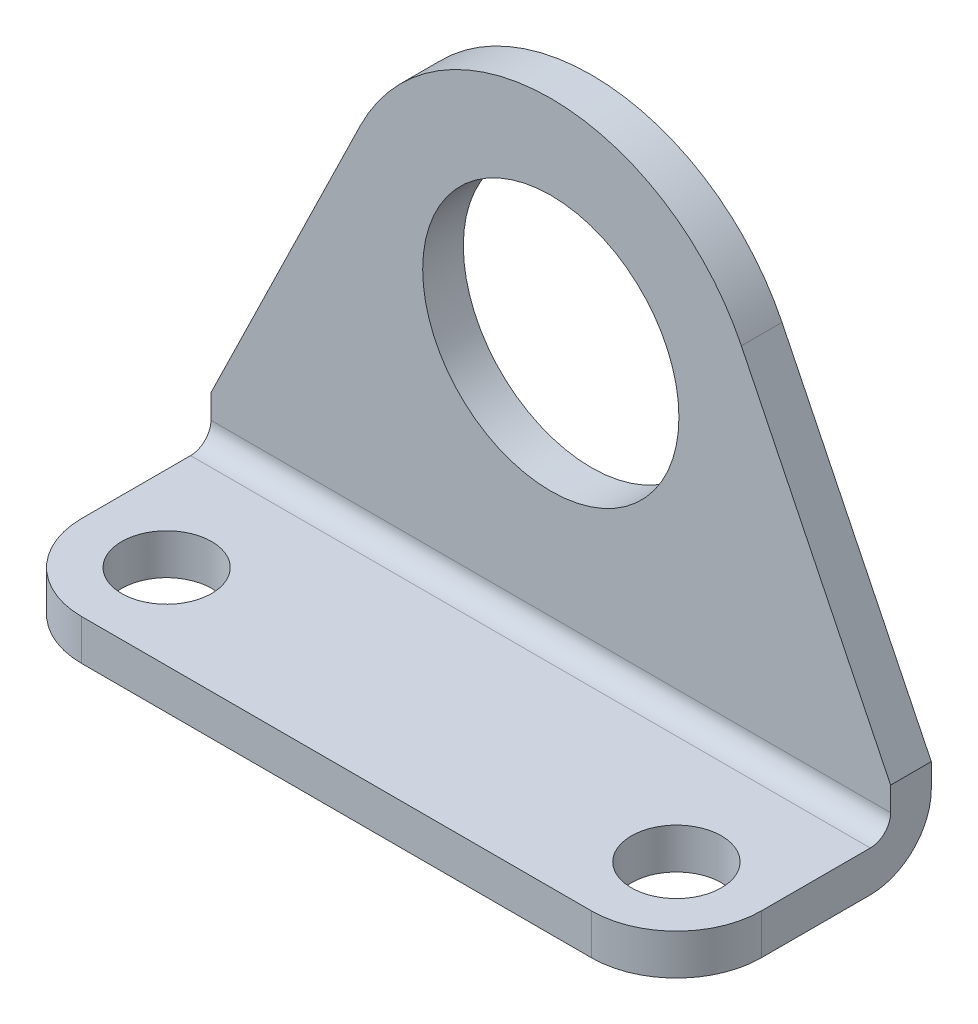
ISO-10303-21;
HEADER;
FILE_DESCRIPTION(('STEP AP214'),'2;1');
FILE_NAME('part.step','',(''),(''),'','','');
FILE_SCHEMA(('AUTOMOTIVE_DESIGN { 1 0 10303 214 1 1 1 1 }'));
ENDSEC;
DATA;
#1=APPLICATION_CONTEXT('core data for automotive mechanical design processes');
#2=APPLICATION_PROTOCOL_DEFINITION('international standard','automotive_design',2000,#1);
#3=PRODUCT_CONTEXT('',#1,'mechanical');
#4=PRODUCT('Part','Part','',(#3));
#5=PRODUCT_RELATED_PRODUCT_CATEGORY('part','',(#4));
#6=PRODUCT_DEFINITION_FORMATION('','',#4);
#7=PRODUCT_DEFINITION_CONTEXT('part definition',#1,'design');
#8=PRODUCT_DEFINITION('design','',#6,#7);
#9=PRODUCT_DEFINITION_SHAPE('','',#8);
#10=(LENGTH_UNIT() NAMED_UNIT(*) SI_UNIT(.MILLI.,.METRE.));
#11=(NAMED_UNIT(*) PLANE_ANGLE_UNIT() SI_UNIT($,.RADIAN.));
#12=(NAMED_UNIT(*) SI_UNIT($,.STERADIAN.) SOLID_ANGLE_UNIT());
#13=UNCERTAINTY_MEASURE_WITH_UNIT(LENGTH_MEASURE(1.E-05),#10,'distance_accuracy_value','');
#14=(GEOMETRIC_REPRESENTATION_CONTEXT(3) GLOBAL_UNCERTAINTY_ASSIGNED_CONTEXT((#13)) GLOBAL_UNIT_ASSIGNED_CONTEXT((#10,
#11,#12)) REPRESENTATION_CONTEXT('',''));
#15=CARTESIAN_POINT('',(0.,0.,0.));
#16=DIRECTION('',(0.,0.,1.));
#17=DIRECTION('',(1.,0.,0.));
#18=AXIS2_PLACEMENT_3D('',#15,#16,#17);
#19=CARTESIAN_POINT('',(25.4,1.51892,2.28092));
#20=DIRECTION('',(0.,-1.,0.));
#21=DIRECTION('',(0.,0.,-1.));
#22=AXIS2_PLACEMENT_3D('',#19,#20,#21);
#23=PLANE('',#22);
#24=CARTESIAN_POINT('',(22.225,1.51892,6.35));
#25=DIRECTION('',(0.,-1.,0.));
#26=DIRECTION('',(0.,0.,-1.));
#27=AXIS2_PLACEMENT_3D('',#24,#25,#26);
#28=CIRCLE('',#27,1.68275);
#29=CARTESIAN_POINT('',(22.225,1.51892,4.66725));
#30=VERTEX_POINT('',#29);
#31=EDGE_CURVE('E248',#30,#30,#28,.F.);
#32=ORIENTED_EDGE('',*,*,#31,.F.);
#33=EDGE_LOOP('',(#32));
#34=FACE_BOUND('',#33,.T.);
#35=CARTESIAN_POINT('',(3.175,1.51892,6.35));
#36=DIRECTION('',(0.,-1.,0.));
#37=DIRECTION('',(0.,0.,-1.));
#38=AXIS2_PLACEMENT_3D('',#35,#36,#37);
#39=CIRCLE('',#38,1.68275);
#40=CARTESIAN_POINT('',(3.175,1.51892,4.66725));
#41=VERTEX_POINT('',#40);
#42=EDGE_CURVE('E254',#41,#41,#39,.F.);
#43=ORIENTED_EDGE('',*,*,#42,.F.);
#44=EDGE_LOOP('',(#43));
#45=FACE_BOUND('',#44,.T.);
#46=CARTESIAN_POINT('',(22.2249999999995,1.51892,6.34999999999953));
#47=DIRECTION('',(0.,-1.,0.));
#48=DIRECTION('',(0.,0.,-1.));
#49=AXIS2_PLACEMENT_3D('',#46,#47,#48);
#50=CIRCLE('',#49,3.17500000000047);
#51=CARTESIAN_POINT('',(25.4,1.51892,6.35));
#52=VERTEX_POINT('',#51);
#53=CARTESIAN_POINT('',(22.225,1.51892,9.525));
#54=VERTEX_POINT('',#53);
#55=EDGE_CURVE('E124',#52,#54,#50,.T.);
#56=ORIENTED_EDGE('',*,*,#55,.F.);
#57=DIRECTION('',(0.,0.,1.));
#58=VECTOR('',#57,1.);
#59=CARTESIAN_POINT('',(25.4,1.51892,2.28092));
#60=LINE('',#59,#58);
#61=CARTESIAN_POINT('',(25.4,1.51892,2.28092));
#62=VERTEX_POINT('',#61);
#63=EDGE_CURVE('E188',#62,#52,#60,.T.);
#64=ORIENTED_EDGE('',*,*,#63,.F.);
#65=DIRECTION('',(-1.,0.,0.));
#66=VECTOR('',#65,1.);
#67=CARTESIAN_POINT('',(25.4,1.51892,2.28092));
#68=LINE('',#67,#66);
#69=CARTESIAN_POINT('',(0.,1.51892,2.28092));
#70=VERTEX_POINT('',#69);
#71=EDGE_CURVE('E189',#62,#70,#68,.T.);
#72=ORIENTED_EDGE('',*,*,#71,.T.);
#73=DIRECTION('',(0.,0.,1.));
#74=VECTOR('',#73,1.);
#75=CARTESIAN_POINT('',(0.,1.51892,2.28092));
#76=LINE('',#75,#74);
#77=CARTESIAN_POINT('',(0.,1.51892,6.35));
#78=VERTEX_POINT('',#77);
#79=EDGE_CURVE('E174',#70,#78,#76,.T.);
#80=ORIENTED_EDGE('',*,*,#79,.T.);
#81=CARTESIAN_POINT('',(3.17499999999998,1.51892,6.35000000000002));
#82=DIRECTION('',(0.,-1.,0.));
#83=DIRECTION('',(0.,0.,-1.));
#84=AXIS2_PLACEMENT_3D('',#81,#82,#83);
#85=CIRCLE('',#84,3.17499999999998);
#86=CARTESIAN_POINT('',(3.175,1.51892,9.525));
#87=VERTEX_POINT('',#86);
#88=EDGE_CURVE('E56',#87,#78,#85,.T.);
#89=ORIENTED_EDGE('',*,*,#88,.F.);
#90=DIRECTION('',(-1.,0.,0.));
#91=VECTOR('',#90,1.);
#92=CARTESIAN_POINT('',(25.4,1.51892,9.525));
#93=LINE('',#92,#91);
#94=EDGE_CURVE('E141',#54,#87,#93,.T.);
#95=ORIENTED_EDGE('',*,*,#94,.F.);
#96=EDGE_LOOP('',(#56,#64,#72,#80,#89,#95));
#97=FACE_BOUND('',#96,.T.);
#98=ADVANCED_FACE('F35',(#34,#45,#97),#23,.F.);
#99=CARTESIAN_POINT('',(25.4,0.,9.525));
#100=DIRECTION('',(0.,1.,0.));
#101=DIRECTION('',(0.,0.,1.));
#102=AXIS2_PLACEMENT_3D('',#99,#100,#101);
#103=PLANE('',#102);
#104=CARTESIAN_POINT('',(22.225,0.,6.35));
#105=DIRECTION('',(0.,1.,0.));
#106=DIRECTION('',(0.,0.,1.));
#107=AXIS2_PLACEMENT_3D('',#104,#105,#106);
#108=CIRCLE('',#107,1.68275);
#109=CARTESIAN_POINT('',(22.225,0.,8.03275));
#110=VERTEX_POINT('',#109);
#111=EDGE_CURVE('E245',#110,#110,#108,.T.);
#112=ORIENTED_EDGE('',*,*,#111,.T.);
#113=EDGE_LOOP('',(#112));
#114=FACE_BOUND('',#113,.T.);
#115=CARTESIAN_POINT('',(3.175,0.,6.35));
#116=DIRECTION('',(0.,1.,0.));
#117=DIRECTION('',(0.,0.,1.));
#118=AXIS2_PLACEMENT_3D('',#115,#116,#117);
#119=CIRCLE('',#118,1.68275);
#120=CARTESIAN_POINT('',(3.175,0.,8.03275));
#121=VERTEX_POINT('',#120);
#122=EDGE_CURVE('E251',#121,#121,#119,.T.);
#123=ORIENTED_EDGE('',*,*,#122,.T.);
#124=EDGE_LOOP('',(#123));
#125=FACE_BOUND('',#124,.T.);
#126=CARTESIAN_POINT('',(22.2249999999995,0.,6.34999999999953));
#127=DIRECTION('',(0.,-1.,0.));
#128=DIRECTION('',(0.,0.,-1.));
#129=AXIS2_PLACEMENT_3D('',#126,#127,#128);
#130=CIRCLE('',#129,3.17500000000047);
#131=CARTESIAN_POINT('',(25.4,0.,6.35));
#132=VERTEX_POINT('',#131);
#133=CARTESIAN_POINT('',(22.225,0.,9.525));
#134=VERTEX_POINT('',#133);
#135=EDGE_CURVE('E49',#132,#134,#130,.T.);
#136=ORIENTED_EDGE('',*,*,#135,.T.);
#137=DIRECTION('',(-1.,0.,0.));
#138=VECTOR('',#137,1.);
#139=CARTESIAN_POINT('',(25.4,0.,9.525));
#140=LINE('',#139,#138);
#141=CARTESIAN_POINT('',(3.175,0.,9.525));
#142=VERTEX_POINT('',#141);
#143=EDGE_CURVE('E133',#134,#142,#140,.T.);
#144=ORIENTED_EDGE('',*,*,#143,.T.);
#145=CARTESIAN_POINT('',(3.17499999999998,0.,6.35000000000002));
#146=DIRECTION('',(0.,-1.,0.));
#147=DIRECTION('',(0.,0.,-1.));
#148=AXIS2_PLACEMENT_3D('',#145,#146,#147);
#149=CIRCLE('',#148,3.17499999999998);
#150=CARTESIAN_POINT('',(0.,0.,6.35));
#151=VERTEX_POINT('',#150);
#152=EDGE_CURVE('E163',#142,#151,#149,.T.);
#153=ORIENTED_EDGE('',*,*,#152,.T.);
#154=DIRECTION('',(0.,0.,-1.));
#155=VECTOR('',#154,1.);
#156=CARTESIAN_POINT('',(0.,0.,9.525));
#157=LINE('',#156,#155);
#158=CARTESIAN_POINT('',(0.,0.,2.28092));
#159=VERTEX_POINT('',#158);
#160=EDGE_CURVE('E168',#151,#159,#157,.T.);
#161=ORIENTED_EDGE('',*,*,#160,.T.);
#162=DIRECTION('',(-1.,0.,0.));
#163=VECTOR('',#162,1.);
#164=CARTESIAN_POINT('',(25.4,0.,2.28092));
#165=LINE('',#164,#163);
#166=CARTESIAN_POINT('',(25.4,0.,2.28092));
#167=VERTEX_POINT('',#166);
#168=EDGE_CURVE('E142',#167,#159,#165,.T.);
#169=ORIENTED_EDGE('',*,*,#168,.F.);
#170=DIRECTION('',(0.,0.,-1.));
#171=VECTOR('',#170,1.);
#172=CARTESIAN_POINT('',(25.4,0.,9.525));
#173=LINE('',#172,#171);
#174=EDGE_CURVE('E136',#132,#167,#173,.T.);
#175=ORIENTED_EDGE('',*,*,#174,.F.);
#176=EDGE_LOOP('',(#136,#144,#153,#161,#169,#175));
#177=FACE_BOUND('',#176,.T.);
#178=ADVANCED_FACE('F131',(#114,#125,#177),#103,.F.);
#179=CARTESIAN_POINT('',(25.4,1.51892,9.525));
#180=DIRECTION('',(0.,0.,-1.));
#181=DIRECTION('',(-1.,0.,0.));
#182=AXIS2_PLACEMENT_3D('',#179,#180,#181);
#183=PLANE('',#182);
#184=DIRECTION('',(0.,-1.,0.));
#185=VECTOR('',#184,1.);
#186=CARTESIAN_POINT('',(22.225,2.27838,9.525));
#187=LINE('',#186,#185);
#188=EDGE_CURVE('E121',#54,#134,#187,.T.);
#189=ORIENTED_EDGE('',*,*,#188,.F.);
#190=ORIENTED_EDGE('',*,*,#94,.T.);
#191=DIRECTION('',(0.,-1.,0.));
#192=VECTOR('',#191,1.);
#193=CARTESIAN_POINT('',(3.175,2.27838,9.525));
#194=LINE('',#193,#192);
#195=EDGE_CURVE('E140',#87,#142,#194,.T.);
#196=ORIENTED_EDGE('',*,*,#195,.T.);
#197=ORIENTED_EDGE('',*,*,#143,.F.);
#198=EDGE_LOOP('',(#189,#190,#196,#197));
#199=FACE_BOUND('',#198,.T.);
#200=ADVANCED_FACE('F139',(#199),#183,.F.);
#201=CARTESIAN_POINT('',(25.4,2.28092,2.28092));
#202=DIRECTION('',(1.,0.,0.));
#203=DIRECTION('',(0.,0.,-1.));
#204=AXIS2_PLACEMENT_3D('',#201,#202,#203);
#205=PLANE('',#204);
#206=ORIENTED_EDGE('',*,*,#63,.T.);
#207=DIRECTION('',(0.,-1.,0.));
#208=VECTOR('',#207,1.);
#209=CARTESIAN_POINT('',(25.4,2.28092,6.35));
#210=LINE('',#209,#208);
#211=EDGE_CURVE('E11',#52,#132,#210,.T.);
#212=ORIENTED_EDGE('',*,*,#211,.T.);
#213=ORIENTED_EDGE('',*,*,#174,.T.);
#214=CARTESIAN_POINT('',(25.4,2.28092,2.28092));
#215=DIRECTION('',(1.,0.,0.));
#216=DIRECTION('',(0.,0.,-1.));
#217=AXIS2_PLACEMENT_3D('',#214,#215,#216);
#218=CIRCLE('',#217,2.28092);
#219=CARTESIAN_POINT('',(25.4,2.28092,0.));
#220=VERTEX_POINT('',#219);
#221=EDGE_CURVE('E227',#167,#220,#218,.T.);
#222=ORIENTED_EDGE('',*,*,#221,.T.);
#223=DIRECTION('',(0.,1.,0.));
#224=VECTOR('',#223,1.);
#225=CARTESIAN_POINT('',(25.4,2.28092,0.));
#226=LINE('',#225,#224);
#227=CARTESIAN_POINT('',(25.4,3.17500000000002,0.));
#228=VERTEX_POINT('',#227);
#229=EDGE_CURVE('E203',#220,#228,#226,.T.);
#230=ORIENTED_EDGE('',*,*,#229,.T.);
#231=DIRECTION('',(0.,0.,-1.));
#232=VECTOR('',#231,1.);
#233=CARTESIAN_POINT('',(25.4,3.17500000000002,2.28092));
#234=LINE('',#233,#232);
#235=CARTESIAN_POINT('',(25.4,3.17500000000002,1.51892));
#236=VERTEX_POINT('',#235);
#237=EDGE_CURVE('E153',#236,#228,#234,.T.);
#238=ORIENTED_EDGE('',*,*,#237,.F.);
#239=DIRECTION('',(0.,-1.,0.));
#240=VECTOR('',#239,1.);
#241=CARTESIAN_POINT('',(25.4,22.86,1.51892));
#242=LINE('',#241,#240);
#243=CARTESIAN_POINT('',(25.4,2.28092,1.51892));
#244=VERTEX_POINT('',#243);
#245=EDGE_CURVE('E230',#236,#244,#242,.T.);
#246=ORIENTED_EDGE('',*,*,#245,.T.);
#247=CARTESIAN_POINT('',(25.4,2.28092,2.28092));
#248=DIRECTION('',(-1.,0.,0.));
#249=DIRECTION('',(0.,0.,1.));
#250=AXIS2_PLACEMENT_3D('',#247,#248,#249);
#251=CIRCLE('',#250,0.762);
#252=EDGE_CURVE('E193',#244,#62,#251,.T.);
#253=ORIENTED_EDGE('',*,*,#252,.T.);
#254=EDGE_LOOP('',(#206,#212,#213,#222,#230,#238,#246,#253));
#255=FACE_BOUND('',#254,.T.);
#256=ADVANCED_FACE('F234',(#255),#205,.T.);
#257=CARTESIAN_POINT('',(0.,2.28092,2.28092));
#258=DIRECTION('',(1.,0.,0.));
#259=DIRECTION('',(0.,0.,-1.));
#260=AXIS2_PLACEMENT_3D('',#257,#258,#259);
#261=PLANE('',#260);
#262=DIRECTION('',(0.,-1.,0.));
#263=VECTOR('',#262,1.);
#264=CARTESIAN_POINT('',(0.,2.28092,6.35));
#265=LINE('',#264,#263);
#266=EDGE_CURVE('E42',#78,#151,#265,.T.);
#267=ORIENTED_EDGE('',*,*,#266,.F.);
#268=ORIENTED_EDGE('',*,*,#79,.F.);
#269=CARTESIAN_POINT('',(0.,2.28092,2.28092));
#270=DIRECTION('',(-1.,0.,0.));
#271=DIRECTION('',(0.,0.,1.));
#272=AXIS2_PLACEMENT_3D('',#269,#270,#271);
#273=CIRCLE('',#272,0.762);
#274=CARTESIAN_POINT('',(0.,2.28092,1.51892));
#275=VERTEX_POINT('',#274);
#276=EDGE_CURVE('E186',#275,#70,#273,.T.);
#277=ORIENTED_EDGE('',*,*,#276,.F.);
#278=DIRECTION('',(0.,-1.,0.));
#279=VECTOR('',#278,1.);
#280=CARTESIAN_POINT('',(0.,22.86,1.51892));
#281=LINE('',#280,#279);
#282=CARTESIAN_POINT('',(0.,3.17499999999999,1.51892));
#283=VERTEX_POINT('',#282);
#284=EDGE_CURVE('E184',#283,#275,#281,.T.);
#285=ORIENTED_EDGE('',*,*,#284,.F.);
#286=DIRECTION('',(0.,0.,-1.));
#287=VECTOR('',#286,1.);
#288=CARTESIAN_POINT('',(0.,3.17499999999999,2.28092));
#289=LINE('',#288,#287);
#290=CARTESIAN_POINT('',(0.,3.17499999999999,0.));
#291=VERTEX_POINT('',#290);
#292=EDGE_CURVE('E144',#283,#291,#289,.T.);
#293=ORIENTED_EDGE('',*,*,#292,.T.);
#294=DIRECTION('',(0.,1.,0.));
#295=VECTOR('',#294,1.);
#296=CARTESIAN_POINT('',(0.,2.28092,0.));
#297=LINE('',#296,#295);
#298=CARTESIAN_POINT('',(0.,2.28092,0.));
#299=VERTEX_POINT('',#298);
#300=EDGE_CURVE('E176',#299,#291,#297,.T.);
#301=ORIENTED_EDGE('',*,*,#300,.F.);
#302=CARTESIAN_POINT('',(0.,2.28092,2.28092));
#303=DIRECTION('',(1.,0.,0.));
#304=DIRECTION('',(0.,0.,-1.));
#305=AXIS2_PLACEMENT_3D('',#302,#303,#304);
#306=CIRCLE('',#305,2.28092);
#307=EDGE_CURVE('E173',#159,#299,#306,.T.);
#308=ORIENTED_EDGE('',*,*,#307,.F.);
#309=ORIENTED_EDGE('',*,*,#160,.F.);
#310=EDGE_LOOP('',(#267,#268,#277,#285,#293,#301,#308,#309));
#311=FACE_BOUND('',#310,.T.);
#312=ADVANCED_FACE('F171',(#311),#261,.F.);
#313=CARTESIAN_POINT('',(25.4,2.28092,0.));
#314=DIRECTION('',(0.,0.,1.));
#315=DIRECTION('',(1.,0.,0.));
#316=AXIS2_PLACEMENT_3D('',#313,#314,#315);
#317=PLANE('',#316);
#318=CARTESIAN_POINT('',(12.7,11.1252,0.));
#319=DIRECTION('',(0.,0.,1.));
#320=DIRECTION('',(1.,0.,0.));
#321=AXIS2_PLACEMENT_3D('',#318,#319,#320);
#322=CIRCLE('',#321,4.7879);
#323=CARTESIAN_POINT('',(17.4879,11.1252,0.));
#324=VERTEX_POINT('',#323);
#325=EDGE_CURVE('E161',#324,#324,#322,.T.);
#326=ORIENTED_EDGE('',*,*,#325,.T.);
#327=EDGE_LOOP('',(#326));
#328=FACE_BOUND('',#327,.T.);
#329=ORIENTED_EDGE('',*,*,#300,.T.);
#330=DIRECTION('',(-0.438706623093617,-0.898630346056595,0.));
#331=VECTOR('',#330,1.);
#332=CARTESIAN_POINT('',(5.5785342335707,14.601862246692,0.));
#333=LINE('',#332,#331);
#334=CARTESIAN_POINT('',(5.5785342335707,14.601862246692,0.));
#335=VERTEX_POINT('',#334);
#336=EDGE_CURVE('E160',#335,#291,#333,.T.);
#337=ORIENTED_EDGE('',*,*,#336,.F.);
#338=CARTESIAN_POINT('',(12.6999999999999,11.1252000000005,0.));
#339=DIRECTION('',(0.,0.,1.));
#340=DIRECTION('',(1.,0.,0.));
#341=AXIS2_PLACEMENT_3D('',#338,#339,#340);
#342=CIRCLE('',#341,7.92479999999953);
#343=CARTESIAN_POINT('',(19.821465766429,14.601862246692,0.));
#344=VERTEX_POINT('',#343);
#345=EDGE_CURVE('E263',#344,#335,#342,.T.);
#346=ORIENTED_EDGE('',*,*,#345,.F.);
#347=DIRECTION('',(-0.438706623093637,0.898630346056585,0.));
#348=VECTOR('',#347,1.);
#349=CARTESIAN_POINT('',(26.950018352301,0.,0.));
#350=LINE('',#349,#348);
#351=EDGE_CURVE('E260',#228,#344,#350,.T.);
#352=ORIENTED_EDGE('',*,*,#351,.F.);
#353=ORIENTED_EDGE('',*,*,#229,.F.);
#354=DIRECTION('',(-1.,0.,0.));
#355=VECTOR('',#354,1.);
#356=CARTESIAN_POINT('',(25.4,2.28092,0.));
#357=LINE('',#356,#355);
#358=EDGE_CURVE('E147',#220,#299,#357,.T.);
#359=ORIENTED_EDGE('',*,*,#358,.T.);
#360=EDGE_LOOP('',(#329,#337,#346,#352,#353,#359));
#361=FACE_BOUND('',#360,.T.);
#362=ADVANCED_FACE('F199',(#328,#361),#317,.F.);
#363=CARTESIAN_POINT('',(25.4,22.86,1.51892));
#364=DIRECTION('',(0.,0.,-1.));
#365=DIRECTION('',(-1.,0.,0.));
#366=AXIS2_PLACEMENT_3D('',#363,#364,#365);
#367=PLANE('',#366);
#368=CARTESIAN_POINT('',(12.7,11.1252,1.51892));
#369=DIRECTION('',(0.,0.,-1.));
#370=DIRECTION('',(-1.,0.,0.));
#371=AXIS2_PLACEMENT_3D('',#368,#369,#370);
#372=CIRCLE('',#371,4.7879);
#373=CARTESIAN_POINT('',(7.9121,11.1252,1.51892));
#374=VERTEX_POINT('',#373);
#375=EDGE_CURVE('E158',#374,#374,#372,.F.);
#376=ORIENTED_EDGE('',*,*,#375,.F.);
#377=EDGE_LOOP('',(#376));
#378=FACE_BOUND('',#377,.T.);
#379=CARTESIAN_POINT('',(12.6999999999999,11.1252000000005,1.51892));
#380=DIRECTION('',(0.,0.,-1.));
#381=DIRECTION('',(-1.,0.,0.));
#382=AXIS2_PLACEMENT_3D('',#379,#380,#381);
#383=CIRCLE('',#382,7.92479999999953);
#384=CARTESIAN_POINT('',(19.821465766429,14.601862246692,1.51892));
#385=VERTEX_POINT('',#384);
#386=CARTESIAN_POINT('',(5.5785342335707,14.601862246692,1.51892));
#387=VERTEX_POINT('',#386);
#388=EDGE_CURVE('E155',#385,#387,#383,.F.);
#389=ORIENTED_EDGE('',*,*,#388,.T.);
#390=DIRECTION('',(-0.438706623093617,-0.898630346056595,0.));
#391=VECTOR('',#390,1.);
#392=CARTESIAN_POINT('',(12.6490905680461,29.0849271269466,1.51892));
#393=LINE('',#392,#391);
#394=EDGE_CURVE('E211',#387,#283,#393,.T.);
#395=ORIENTED_EDGE('',*,*,#394,.T.);
#396=ORIENTED_EDGE('',*,*,#284,.T.);
#397=DIRECTION('',(-1.,0.,0.));
#398=VECTOR('',#397,1.);
#399=CARTESIAN_POINT('',(25.4,2.28092,1.51892));
#400=LINE('',#399,#398);
#401=EDGE_CURVE('E192',#244,#275,#400,.T.);
#402=ORIENTED_EDGE('',*,*,#401,.F.);
#403=ORIENTED_EDGE('',*,*,#245,.F.);
#404=DIRECTION('',(-0.438706623093637,0.898630346056585,0.));
#405=VECTOR('',#404,1.);
#406=CARTESIAN_POINT('',(17.6394823610673,19.0713559799366,1.51892));
#407=LINE('',#406,#405);
#408=EDGE_CURVE('E178',#236,#385,#407,.T.);
#409=ORIENTED_EDGE('',*,*,#408,.T.);
#410=EDGE_LOOP('',(#389,#395,#396,#402,#403,#409));
#411=FACE_BOUND('',#410,.T.);
#412=ADVANCED_FACE('F214',(#378,#411),#367,.F.);
#413=CARTESIAN_POINT('',(25.4,2.28092,2.28092));
#414=DIRECTION('',(-1.,0.,0.));
#415=DIRECTION('',(0.,0.,1.));
#416=AXIS2_PLACEMENT_3D('',#413,#414,#415);
#417=CYLINDRICAL_SURFACE('',#416,2.28092);
#418=ORIENTED_EDGE('',*,*,#307,.T.);
#419=ORIENTED_EDGE('',*,*,#358,.F.);
#420=ORIENTED_EDGE('',*,*,#221,.F.);
#421=ORIENTED_EDGE('',*,*,#168,.T.);
#422=EDGE_LOOP('',(#418,#419,#420,#421));
#423=FACE_BOUND('',#422,.T.);
#424=ADVANCED_FACE('F270',(#423),#417,.T.);
#425=CARTESIAN_POINT('',(25.4,2.28092,2.28092));
#426=DIRECTION('',(-1.,0.,0.));
#427=DIRECTION('',(0.,0.,1.));
#428=AXIS2_PLACEMENT_3D('',#425,#426,#427);
#429=CYLINDRICAL_SURFACE('',#428,0.762);
#430=ORIENTED_EDGE('',*,*,#276,.T.);
#431=ORIENTED_EDGE('',*,*,#71,.F.);
#432=ORIENTED_EDGE('',*,*,#252,.F.);
#433=ORIENTED_EDGE('',*,*,#401,.T.);
#434=EDGE_LOOP('',(#430,#431,#432,#433));
#435=FACE_BOUND('',#434,.T.);
#436=ADVANCED_FACE('F239',(#435),#429,.F.);
#437=CARTESIAN_POINT('',(12.6999999999999,11.1252000000005,2.27838));
#438=DIRECTION('',(0.,0.,-1.));
#439=DIRECTION('',(-1.,0.,0.));
#440=AXIS2_PLACEMENT_3D('',#437,#438,#439);
#441=CYLINDRICAL_SURFACE('',#440,7.92479999999953);
#442=DIRECTION('',(0.,0.,-1.));
#443=VECTOR('',#442,1.);
#444=CARTESIAN_POINT('',(19.821465766429,14.601862246692,2.27838));
#445=LINE('',#444,#443);
#446=EDGE_CURVE('E217',#385,#344,#445,.T.);
#447=ORIENTED_EDGE('',*,*,#446,.T.);
#448=ORIENTED_EDGE('',*,*,#345,.T.);
#449=DIRECTION('',(0.,0.,-1.));
#450=VECTOR('',#449,1.);
#451=CARTESIAN_POINT('',(5.5785342335707,14.601862246692,2.27838));
#452=LINE('',#451,#450);
#453=EDGE_CURVE('E220',#387,#335,#452,.T.);
#454=ORIENTED_EDGE('',*,*,#453,.F.);
#455=ORIENTED_EDGE('',*,*,#388,.F.);
#456=EDGE_LOOP('',(#447,#448,#454,#455));
#457=FACE_BOUND('',#456,.T.);
#458=ADVANCED_FACE('F267',(#457),#441,.T.);
#459=CARTESIAN_POINT('',(26.950018352301,0.,2.27838));
#460=DIRECTION('',(-0.898630346056585,-0.438706623093637,0.));
#461=DIRECTION('',(0.438706623093637,-0.898630346056585,0.));
#462=AXIS2_PLACEMENT_3D('',#459,#460,#461);
#463=PLANE('',#462);
#464=ORIENTED_EDGE('',*,*,#237,.T.);
#465=ORIENTED_EDGE('',*,*,#351,.T.);
#466=ORIENTED_EDGE('',*,*,#446,.F.);
#467=ORIENTED_EDGE('',*,*,#408,.F.);
#468=EDGE_LOOP('',(#464,#465,#466,#467));
#469=FACE_BOUND('',#468,.T.);
#470=ADVANCED_FACE('F311',(#469),#463,.F.);
#471=CARTESIAN_POINT('',(5.5785342335707,14.601862246692,2.27838));
#472=DIRECTION('',(0.898630346056595,-0.438706623093617,0.));
#473=DIRECTION('',(0.438706623093617,0.898630346056595,0.));
#474=AXIS2_PLACEMENT_3D('',#471,#472,#473);
#475=PLANE('',#474);
#476=ORIENTED_EDGE('',*,*,#453,.T.);
#477=ORIENTED_EDGE('',*,*,#336,.T.);
#478=ORIENTED_EDGE('',*,*,#292,.F.);
#479=ORIENTED_EDGE('',*,*,#394,.F.);
#480=EDGE_LOOP('',(#476,#477,#478,#479));
#481=FACE_BOUND('',#480,.T.);
#482=ADVANCED_FACE('F210',(#481),#475,.F.);
#483=CARTESIAN_POINT('',(12.7,11.1252,2.27838));
#484=DIRECTION('',(0.,0.,-1.));
#485=DIRECTION('',(-1.,0.,0.));
#486=AXIS2_PLACEMENT_3D('',#483,#484,#485);
#487=CYLINDRICAL_SURFACE('',#486,4.7879);
#488=ORIENTED_EDGE('',*,*,#325,.F.);
#489=EDGE_LOOP('',(#488));
#490=FACE_BOUND('',#489,.T.);
#491=ORIENTED_EDGE('',*,*,#375,.T.);
#492=EDGE_LOOP('',(#491));
#493=FACE_BOUND('',#492,.T.);
#494=ADVANCED_FACE('F295',(#490,#493),#487,.F.);
#495=CARTESIAN_POINT('',(3.175,2.27838,6.35));
#496=DIRECTION('',(0.,-1.,0.));
#497=DIRECTION('',(0.,0.,-1.));
#498=AXIS2_PLACEMENT_3D('',#495,#496,#497);
#499=CYLINDRICAL_SURFACE('',#498,1.68275);
#500=ORIENTED_EDGE('',*,*,#122,.F.);
#501=EDGE_LOOP('',(#500));
#502=FACE_BOUND('',#501,.T.);
#503=ORIENTED_EDGE('',*,*,#42,.T.);
#504=EDGE_LOOP('',(#503));
#505=FACE_BOUND('',#504,.T.);
#506=ADVANCED_FACE('F292',(#502,#505),#499,.F.);
#507=CARTESIAN_POINT('',(22.225,2.27838,6.35));
#508=DIRECTION('',(0.,-1.,0.));
#509=DIRECTION('',(0.,0.,-1.));
#510=AXIS2_PLACEMENT_3D('',#507,#508,#509);
#511=CYLINDRICAL_SURFACE('',#510,1.68275);
#512=ORIENTED_EDGE('',*,*,#111,.F.);
#513=EDGE_LOOP('',(#512));
#514=FACE_BOUND('',#513,.T.);
#515=ORIENTED_EDGE('',*,*,#31,.T.);
#516=EDGE_LOOP('',(#515));
#517=FACE_BOUND('',#516,.T.);
#518=ADVANCED_FACE('F294',(#514,#517),#511,.F.);
#519=CARTESIAN_POINT('',(3.17499999999998,2.27838,6.35000000000002));
#520=DIRECTION('',(0.,-1.,0.));
#521=DIRECTION('',(0.,0.,-1.));
#522=AXIS2_PLACEMENT_3D('',#519,#520,#521);
#523=CYLINDRICAL_SURFACE('',#522,3.17499999999998);
#524=ORIENTED_EDGE('',*,*,#88,.T.);
#525=ORIENTED_EDGE('',*,*,#266,.T.);
#526=ORIENTED_EDGE('',*,*,#152,.F.);
#527=ORIENTED_EDGE('',*,*,#195,.F.);
#528=EDGE_LOOP('',(#524,#525,#526,#527));
#529=FACE_BOUND('',#528,.T.);
#530=ADVANCED_FACE('F162',(#529),#523,.T.);
#531=CARTESIAN_POINT('',(22.2249999999995,2.27838,6.34999999999953));
#532=DIRECTION('',(0.,-1.,0.));
#533=DIRECTION('',(0.,0.,-1.));
#534=AXIS2_PLACEMENT_3D('',#531,#532,#533);
#535=CYLINDRICAL_SURFACE('',#534,3.17500000000047);
#536=ORIENTED_EDGE('',*,*,#55,.T.);
#537=ORIENTED_EDGE('',*,*,#188,.T.);
#538=ORIENTED_EDGE('',*,*,#135,.F.);
#539=ORIENTED_EDGE('',*,*,#211,.F.);
#540=EDGE_LOOP('',(#536,#537,#538,#539));
#541=FACE_BOUND('',#540,.T.);
#542=ADVANCED_FACE('F122',(#541),#535,.T.);
#543=CLOSED_SHELL('',(#98,#178,#200,#256,#312,#362,#412,#424,#436,#458,#470,#482,#494,#506,#518,
#530,#542));
#544=MANIFOLD_SOLID_BREP('B2',#543);
#545=ADVANCED_BREP_SHAPE_REPRESENTATION('',(#18,#544),#14);
#546=SHAPE_DEFINITION_REPRESENTATION(#9,#545);
ENDSEC;
END-ISO-10303-21;
